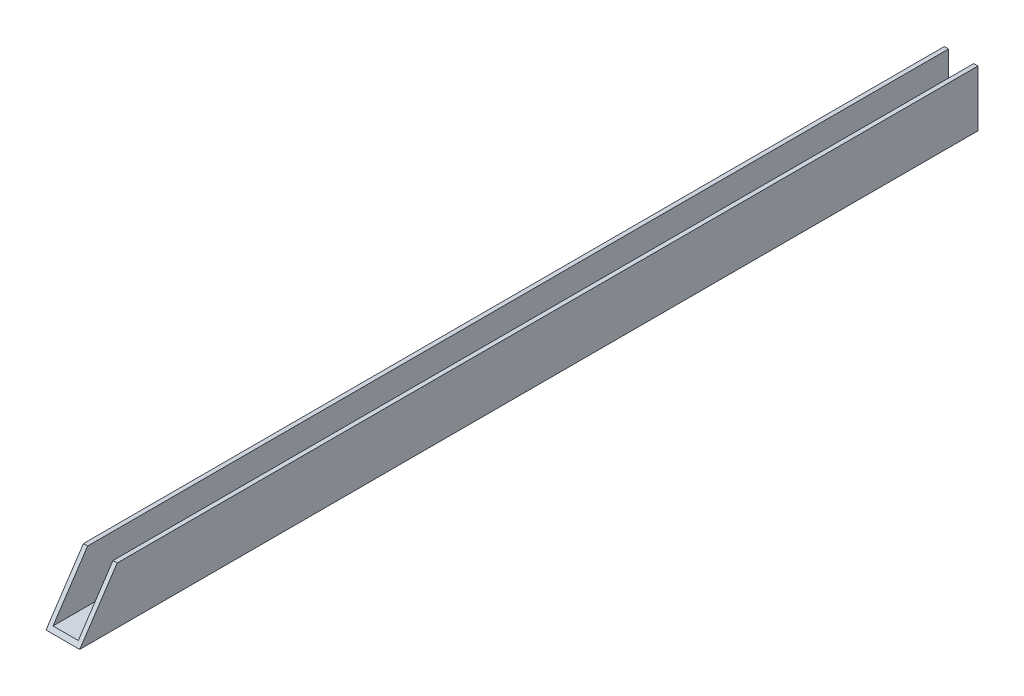
ISO-10303-21;
HEADER;
FILE_DESCRIPTION(('STEP AP214'),'2;1');
FILE_NAME('part.step','',(''),(''),'','','');
FILE_SCHEMA(('AUTOMOTIVE_DESIGN { 1 0 10303 214 1 1 1 1 }'));
ENDSEC;
DATA;
#1=APPLICATION_CONTEXT('core data for automotive mechanical design processes');
#2=APPLICATION_PROTOCOL_DEFINITION('international standard','automotive_design',2000,#1);
#3=PRODUCT_CONTEXT('',#1,'mechanical');
#4=PRODUCT('Part','Part','',(#3));
#5=PRODUCT_RELATED_PRODUCT_CATEGORY('part','',(#4));
#6=PRODUCT_DEFINITION_FORMATION('','',#4);
#7=PRODUCT_DEFINITION_CONTEXT('part definition',#1,'design');
#8=PRODUCT_DEFINITION('design','',#6,#7);
#9=PRODUCT_DEFINITION_SHAPE('','',#8);
#10=(LENGTH_UNIT() NAMED_UNIT(*) SI_UNIT(.MILLI.,.METRE.));
#11=(NAMED_UNIT(*) PLANE_ANGLE_UNIT() SI_UNIT($,.RADIAN.));
#12=(NAMED_UNIT(*) SI_UNIT($,.STERADIAN.) SOLID_ANGLE_UNIT());
#13=UNCERTAINTY_MEASURE_WITH_UNIT(LENGTH_MEASURE(1.E-05),#10,'distance_accuracy_value','');
#14=(GEOMETRIC_REPRESENTATION_CONTEXT(3) GLOBAL_UNCERTAINTY_ASSIGNED_CONTEXT((#13)) GLOBAL_UNIT_ASSIGNED_CONTEXT((#10,
#11,#12)) REPRESENTATION_CONTEXT('',''));
#15=CARTESIAN_POINT('',(0.,0.,0.));
#16=DIRECTION('',(0.,0.,1.));
#17=DIRECTION('',(1.,0.,0.));
#18=AXIS2_PLACEMENT_3D('',#15,#16,#17);
#19=CARTESIAN_POINT('',(-3.571875,1.190625,127.));
#20=DIRECTION('',(-1.,0.,0.));
#21=DIRECTION('',(0.,0.,1.));
#22=AXIS2_PLACEMENT_3D('',#19,#20,#21);
#23=PLANE('',#22);
#24=DIRECTION('',(0.,0.,-1.));
#25=VECTOR('',#24,1.);
#26=CARTESIAN_POINT('',(-3.571875,15.875,127.));
#27=LINE('',#26,#25);
#28=CARTESIAN_POINT('',(-3.571875,15.875,116.416666666667));
#29=VERTEX_POINT('',#28);
#30=CARTESIAN_POINT('',(-3.571875,15.875,-127.));
#31=VERTEX_POINT('',#30);
#32=EDGE_CURVE('E11',#29,#31,#27,.T.);
#33=ORIENTED_EDGE('',*,*,#32,.F.);
#34=DIRECTION('',(0.,-0.832050294337844,0.554700196225228));
#35=VECTOR('',#34,1.);
#36=CARTESIAN_POINT('',(-3.571875,0.824278846153846,126.450480769231));
#37=LINE('',#36,#35);
#38=CARTESIAN_POINT('',(-3.571875,1.190625,126.20625));
#39=VERTEX_POINT('',#38);
#40=EDGE_CURVE('E172',#29,#39,#37,.T.);
#41=ORIENTED_EDGE('',*,*,#40,.T.);
#42=DIRECTION('',(0.,0.,-1.));
#43=VECTOR('',#42,1.);
#44=CARTESIAN_POINT('',(-3.571875,1.190625,127.));
#45=LINE('',#44,#43);
#46=CARTESIAN_POINT('',(-3.571875,1.190625,-127.));
#47=VERTEX_POINT('',#46);
#48=EDGE_CURVE('E94',#39,#47,#45,.T.);
#49=ORIENTED_EDGE('',*,*,#48,.T.);
#50=DIRECTION('',(0.,1.,0.));
#51=VECTOR('',#50,1.);
#52=CARTESIAN_POINT('',(-3.571875,1.190625,-127.));
#53=LINE('',#52,#51);
#54=EDGE_CURVE('E108',#47,#31,#53,.T.);
#55=ORIENTED_EDGE('',*,*,#54,.T.);
#56=EDGE_LOOP('',(#33,#41,#49,#55));
#57=FACE_BOUND('',#56,.T.);
#58=ADVANCED_FACE('F37',(#57),#23,.F.);
#59=CARTESIAN_POINT('',(-3.571875,15.875,127.));
#60=DIRECTION('',(0.,-1.,0.));
#61=DIRECTION('',(0.,0.,-1.));
#62=AXIS2_PLACEMENT_3D('',#59,#60,#61);
#63=PLANE('',#62);
#64=DIRECTION('',(0.,0.,-1.));
#65=VECTOR('',#64,1.);
#66=CARTESIAN_POINT('',(-4.7625,15.875,127.));
#67=LINE('',#66,#65);
#68=CARTESIAN_POINT('',(-4.7625,15.875,116.416666666667));
#69=VERTEX_POINT('',#68);
#70=CARTESIAN_POINT('',(-4.7625,15.875,-127.));
#71=VERTEX_POINT('',#70);
#72=EDGE_CURVE('E45',#69,#71,#67,.T.);
#73=ORIENTED_EDGE('',*,*,#72,.F.);
#74=DIRECTION('',(1.,0.,0.));
#75=VECTOR('',#74,1.);
#76=CARTESIAN_POINT('',(-3.571875,15.875,116.416666666667));
#77=LINE('',#76,#75);
#78=EDGE_CURVE('E174',#69,#29,#77,.T.);
#79=ORIENTED_EDGE('',*,*,#78,.T.);
#80=ORIENTED_EDGE('',*,*,#32,.T.);
#81=DIRECTION('',(-1.,0.,0.));
#82=VECTOR('',#81,1.);
#83=CARTESIAN_POINT('',(-3.571875,15.875,-127.));
#84=LINE('',#83,#82);
#85=EDGE_CURVE('E132',#31,#71,#84,.T.);
#86=ORIENTED_EDGE('',*,*,#85,.T.);
#87=EDGE_LOOP('',(#73,#79,#80,#86));
#88=FACE_BOUND('',#87,.T.);
#89=ADVANCED_FACE('F133',(#88),#63,.F.);
#90=CARTESIAN_POINT('',(-4.7625,15.875,127.));
#91=DIRECTION('',(1.,0.,0.));
#92=DIRECTION('',(0.,0.,-1.));
#93=AXIS2_PLACEMENT_3D('',#90,#91,#92);
#94=PLANE('',#93);
#95=DIRECTION('',(0.,0.,-1.));
#96=VECTOR('',#95,1.);
#97=CARTESIAN_POINT('',(-4.7625,0.,127.));
#98=LINE('',#97,#96);
#99=CARTESIAN_POINT('',(-4.7625,0.,127.));
#100=VERTEX_POINT('',#99);
#101=CARTESIAN_POINT('',(-4.7625,0.,-127.));
#102=VERTEX_POINT('',#101);
#103=EDGE_CURVE('E121',#100,#102,#98,.T.);
#104=ORIENTED_EDGE('',*,*,#103,.F.);
#105=DIRECTION('',(0.,-0.832050294337844,0.554700196225228));
#106=VECTOR('',#105,1.);
#107=CARTESIAN_POINT('',(-4.7625,0.,127.));
#108=LINE('',#107,#106);
#109=EDGE_CURVE('E52',#69,#100,#108,.T.);
#110=ORIENTED_EDGE('',*,*,#109,.F.);
#111=ORIENTED_EDGE('',*,*,#72,.T.);
#112=DIRECTION('',(0.,-1.,0.));
#113=VECTOR('',#112,1.);
#114=CARTESIAN_POINT('',(-4.7625,15.875,-127.));
#115=LINE('',#114,#113);
#116=EDGE_CURVE('E128',#71,#102,#115,.T.);
#117=ORIENTED_EDGE('',*,*,#116,.T.);
#118=EDGE_LOOP('',(#104,#110,#111,#117));
#119=FACE_BOUND('',#118,.T.);
#120=ADVANCED_FACE('F126',(#119),#94,.F.);
#121=CARTESIAN_POINT('',(-4.7625,0.,127.));
#122=DIRECTION('',(0.,1.,0.));
#123=DIRECTION('',(0.,0.,1.));
#124=AXIS2_PLACEMENT_3D('',#121,#122,#123);
#125=PLANE('',#124);
#126=DIRECTION('',(1.,0.,0.));
#127=VECTOR('',#126,1.);
#128=CARTESIAN_POINT('',(-4.7625,0.,-127.));
#129=LINE('',#128,#127);
#130=CARTESIAN_POINT('',(4.7625,0.,-127.));
#131=VERTEX_POINT('',#130);
#132=EDGE_CURVE('E138',#102,#131,#129,.T.);
#133=ORIENTED_EDGE('',*,*,#132,.T.);
#134=DIRECTION('',(0.,0.,-1.));
#135=VECTOR('',#134,1.);
#136=CARTESIAN_POINT('',(4.7625,0.,127.));
#137=LINE('',#136,#135);
#138=CARTESIAN_POINT('',(4.7625,0.,127.));
#139=VERTEX_POINT('',#138);
#140=EDGE_CURVE('E118',#139,#131,#137,.T.);
#141=ORIENTED_EDGE('',*,*,#140,.F.);
#142=DIRECTION('',(1.,0.,0.));
#143=VECTOR('',#142,1.);
#144=CARTESIAN_POINT('',(-4.7625,0.,127.));
#145=LINE('',#144,#143);
#146=EDGE_CURVE('E109',#100,#139,#145,.T.);
#147=ORIENTED_EDGE('',*,*,#146,.F.);
#148=ORIENTED_EDGE('',*,*,#103,.T.);
#149=EDGE_LOOP('',(#133,#141,#147,#148));
#150=FACE_BOUND('',#149,.T.);
#151=ADVANCED_FACE('F160',(#150),#125,.F.);
#152=CARTESIAN_POINT('',(4.7625,0.,127.));
#153=DIRECTION('',(-1.,0.,0.));
#154=DIRECTION('',(0.,0.,1.));
#155=AXIS2_PLACEMENT_3D('',#152,#153,#154);
#156=PLANE('',#155);
#157=DIRECTION('',(0.,0.,-1.));
#158=VECTOR('',#157,1.);
#159=CARTESIAN_POINT('',(4.7625,15.875,127.));
#160=LINE('',#159,#158);
#161=CARTESIAN_POINT('',(4.7625,15.875,116.416666666667));
#162=VERTEX_POINT('',#161);
#163=CARTESIAN_POINT('',(4.7625,15.875,-127.));
#164=VERTEX_POINT('',#163);
#165=EDGE_CURVE('E116',#162,#164,#160,.T.);
#166=ORIENTED_EDGE('',*,*,#165,.F.);
#167=DIRECTION('',(0.,-0.832050294337844,0.554700196225228));
#168=VECTOR('',#167,1.);
#169=CARTESIAN_POINT('',(4.7625,14.084496605548,117.610335596301));
#170=LINE('',#169,#168);
#171=EDGE_CURVE('E157',#162,#139,#170,.T.);
#172=ORIENTED_EDGE('',*,*,#171,.T.);
#173=ORIENTED_EDGE('',*,*,#140,.T.);
#174=DIRECTION('',(0.,1.,0.));
#175=VECTOR('',#174,1.);
#176=CARTESIAN_POINT('',(4.7625,0.,-127.));
#177=LINE('',#176,#175);
#178=EDGE_CURVE('E140',#131,#164,#177,.T.);
#179=ORIENTED_EDGE('',*,*,#178,.T.);
#180=EDGE_LOOP('',(#166,#172,#173,#179));
#181=FACE_BOUND('',#180,.T.);
#182=ADVANCED_FACE('F151',(#181),#156,.F.);
#183=CARTESIAN_POINT('',(4.7625,15.875,127.));
#184=DIRECTION('',(0.,-1.,0.));
#185=DIRECTION('',(0.,0.,-1.));
#186=AXIS2_PLACEMENT_3D('',#183,#184,#185);
#187=PLANE('',#186);
#188=DIRECTION('',(0.,0.,-1.));
#189=VECTOR('',#188,1.);
#190=CARTESIAN_POINT('',(3.571875,15.875,127.));
#191=LINE('',#190,#189);
#192=CARTESIAN_POINT('',(3.571875,15.875,116.416666666667));
#193=VERTEX_POINT('',#192);
#194=CARTESIAN_POINT('',(3.571875,15.875,-127.));
#195=VERTEX_POINT('',#194);
#196=EDGE_CURVE('E93',#193,#195,#191,.T.);
#197=ORIENTED_EDGE('',*,*,#196,.F.);
#198=DIRECTION('',(1.,0.,0.));
#199=VECTOR('',#198,1.);
#200=CARTESIAN_POINT('',(4.7625,15.875,116.416666666667));
#201=LINE('',#200,#199);
#202=EDGE_CURVE('E169',#193,#162,#201,.T.);
#203=ORIENTED_EDGE('',*,*,#202,.T.);
#204=ORIENTED_EDGE('',*,*,#165,.T.);
#205=DIRECTION('',(-1.,0.,0.));
#206=VECTOR('',#205,1.);
#207=CARTESIAN_POINT('',(4.7625,15.875,-127.));
#208=LINE('',#207,#206);
#209=EDGE_CURVE('E103',#164,#195,#208,.T.);
#210=ORIENTED_EDGE('',*,*,#209,.T.);
#211=EDGE_LOOP('',(#197,#203,#204,#210));
#212=FACE_BOUND('',#211,.T.);
#213=ADVANCED_FACE('F146',(#212),#187,.F.);
#214=CARTESIAN_POINT('',(3.571875,15.875,127.));
#215=DIRECTION('',(1.,0.,0.));
#216=DIRECTION('',(0.,0.,-1.));
#217=AXIS2_PLACEMENT_3D('',#214,#215,#216);
#218=PLANE('',#217);
#219=DIRECTION('',(0.,0.,-1.));
#220=VECTOR('',#219,1.);
#221=CARTESIAN_POINT('',(3.571875,1.190625,127.));
#222=LINE('',#221,#220);
#223=CARTESIAN_POINT('',(3.571875,1.190625,126.20625));
#224=VERTEX_POINT('',#223);
#225=CARTESIAN_POINT('',(3.571875,1.190625,-127.));
#226=VERTEX_POINT('',#225);
#227=EDGE_CURVE('E81',#224,#226,#222,.T.);
#228=ORIENTED_EDGE('',*,*,#227,.F.);
#229=DIRECTION('',(0.,0.832050294337844,-0.554700196225228));
#230=VECTOR('',#229,1.);
#231=CARTESIAN_POINT('',(3.571875,10.9903846153846,119.673076923077));
#232=LINE('',#231,#230);
#233=EDGE_CURVE('E180',#224,#193,#232,.T.);
#234=ORIENTED_EDGE('',*,*,#233,.T.);
#235=ORIENTED_EDGE('',*,*,#196,.T.);
#236=DIRECTION('',(0.,-1.,0.));
#237=VECTOR('',#236,1.);
#238=CARTESIAN_POINT('',(3.571875,15.875,-127.));
#239=LINE('',#238,#237);
#240=EDGE_CURVE('E97',#195,#226,#239,.T.);
#241=ORIENTED_EDGE('',*,*,#240,.T.);
#242=EDGE_LOOP('',(#228,#234,#235,#241));
#243=FACE_BOUND('',#242,.T.);
#244=ADVANCED_FACE('F98',(#243),#218,.F.);
#245=CARTESIAN_POINT('',(3.571875,1.190625,127.));
#246=DIRECTION('',(0.,-1.,0.));
#247=DIRECTION('',(0.,0.,-1.));
#248=AXIS2_PLACEMENT_3D('',#245,#246,#247);
#249=PLANE('',#248);
#250=ORIENTED_EDGE('',*,*,#48,.F.);
#251=DIRECTION('',(1.,0.,0.));
#252=VECTOR('',#251,1.);
#253=CARTESIAN_POINT('',(3.571875,1.190625,126.20625));
#254=LINE('',#253,#252);
#255=EDGE_CURVE('E90',#39,#224,#254,.T.);
#256=ORIENTED_EDGE('',*,*,#255,.T.);
#257=ORIENTED_EDGE('',*,*,#227,.T.);
#258=DIRECTION('',(-1.,0.,0.));
#259=VECTOR('',#258,1.);
#260=CARTESIAN_POINT('',(3.571875,1.190625,-127.));
#261=LINE('',#260,#259);
#262=EDGE_CURVE('E86',#226,#47,#261,.T.);
#263=ORIENTED_EDGE('',*,*,#262,.T.);
#264=EDGE_LOOP('',(#250,#256,#257,#263));
#265=FACE_BOUND('',#264,.T.);
#266=ADVANCED_FACE('F84',(#265),#249,.F.);
#267=CARTESIAN_POINT('',(-3.571875,15.875,-127.));
#268=DIRECTION('',(0.,0.,1.));
#269=DIRECTION('',(1.,0.,0.));
#270=AXIS2_PLACEMENT_3D('',#267,#268,#269);
#271=PLANE('',#270);
#272=ORIENTED_EDGE('',*,*,#54,.F.);
#273=ORIENTED_EDGE('',*,*,#262,.F.);
#274=ORIENTED_EDGE('',*,*,#240,.F.);
#275=ORIENTED_EDGE('',*,*,#209,.F.);
#276=ORIENTED_EDGE('',*,*,#178,.F.);
#277=ORIENTED_EDGE('',*,*,#132,.F.);
#278=ORIENTED_EDGE('',*,*,#116,.F.);
#279=ORIENTED_EDGE('',*,*,#85,.F.);
#280=EDGE_LOOP('',(#272,#273,#274,#275,#276,#277,#278,#279));
#281=FACE_BOUND('',#280,.T.);
#282=ADVANCED_FACE('F105',(#281),#271,.F.);
#283=CARTESIAN_POINT('',(4.7625,0.,127.));
#284=DIRECTION('',(0.,-0.554700196225228,-0.832050294337844));
#285=DIRECTION('',(0.,0.832050294337844,-0.554700196225228));
#286=AXIS2_PLACEMENT_3D('',#283,#284,#285);
#287=PLANE('',#286);
#288=ORIENTED_EDGE('',*,*,#109,.T.);
#289=ORIENTED_EDGE('',*,*,#146,.T.);
#290=ORIENTED_EDGE('',*,*,#171,.F.);
#291=ORIENTED_EDGE('',*,*,#202,.F.);
#292=ORIENTED_EDGE('',*,*,#233,.F.);
#293=ORIENTED_EDGE('',*,*,#255,.F.);
#294=ORIENTED_EDGE('',*,*,#40,.F.);
#295=ORIENTED_EDGE('',*,*,#78,.F.);
#296=EDGE_LOOP('',(#288,#289,#290,#291,#292,#293,#294,#295));
#297=FACE_BOUND('',#296,.T.);
#298=ADVANCED_FACE('F173',(#297),#287,.F.);
#299=CLOSED_SHELL('',(#58,#89,#120,#151,#182,#213,#244,#266,#282,#298));
#300=MANIFOLD_SOLID_BREP('B2',#299);
#301=ADVANCED_BREP_SHAPE_REPRESENTATION('',(#18,#300),#14);
#302=SHAPE_DEFINITION_REPRESENTATION(#9,#301);
ENDSEC;
END-ISO-10303-21;
